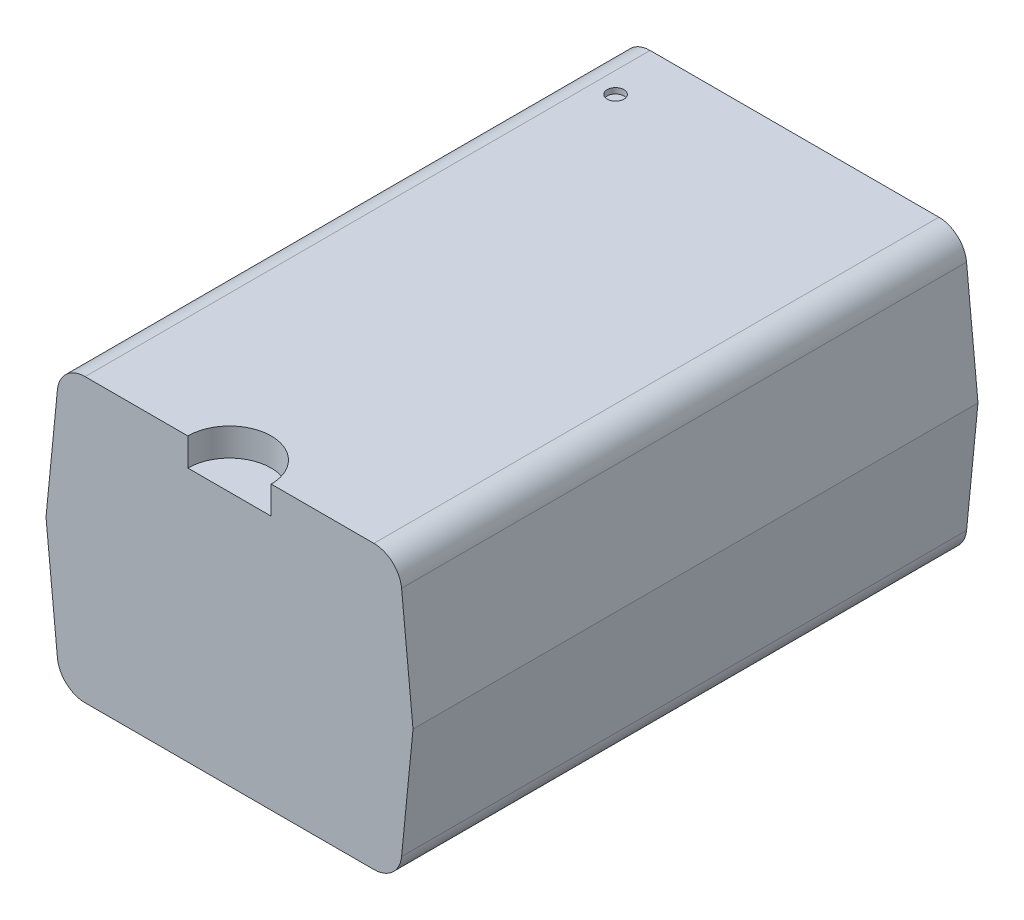
ISO-10303-21;
HEADER;
FILE_DESCRIPTION(('STEP AP214'),'2;1');
FILE_NAME('part.step','',(''),(''),'','','');
FILE_SCHEMA(('AUTOMOTIVE_DESIGN { 1 0 10303 214 1 1 1 1 }'));
ENDSEC;
DATA;
#1=APPLICATION_CONTEXT('core data for automotive mechanical design processes');
#2=APPLICATION_PROTOCOL_DEFINITION('international standard','automotive_design',2000,#1);
#3=PRODUCT_CONTEXT('',#1,'mechanical');
#4=PRODUCT('Part','Part','',(#3));
#5=PRODUCT_RELATED_PRODUCT_CATEGORY('part','',(#4));
#6=PRODUCT_DEFINITION_FORMATION('','',#4);
#7=PRODUCT_DEFINITION_CONTEXT('part definition',#1,'design');
#8=PRODUCT_DEFINITION('design','',#6,#7);
#9=PRODUCT_DEFINITION_SHAPE('','',#8);
#10=(LENGTH_UNIT() NAMED_UNIT(*) SI_UNIT(.MILLI.,.METRE.));
#11=(NAMED_UNIT(*) PLANE_ANGLE_UNIT() SI_UNIT($,.RADIAN.));
#12=(NAMED_UNIT(*) SI_UNIT($,.STERADIAN.) SOLID_ANGLE_UNIT());
#13=UNCERTAINTY_MEASURE_WITH_UNIT(LENGTH_MEASURE(1.E-05),#10,'distance_accuracy_value','');
#14=(GEOMETRIC_REPRESENTATION_CONTEXT(3) GLOBAL_UNCERTAINTY_ASSIGNED_CONTEXT((#13)) GLOBAL_UNIT_ASSIGNED_CONTEXT((#10,
#11,#12)) REPRESENTATION_CONTEXT('',''));
#15=CARTESIAN_POINT('',(0.,0.,0.));
#16=DIRECTION('',(0.,0.,1.));
#17=DIRECTION('',(1.,0.,0.));
#18=AXIS2_PLACEMENT_3D('',#15,#16,#17);
#19=CARTESIAN_POINT('',(-33.7891764057283,21.1911888467441,10.16));
#20=DIRECTION('',(0.995191151601001,-0.0979518850000986,0.));
#21=DIRECTION('',(0.0979518850000986,0.995191151601001,0.));
#22=AXIS2_PLACEMENT_3D('',#19,#20,#21);
#23=PLANE('',#22);
#24=DIRECTION('',(-0.0979518850000986,-0.995191151601001,0.));
#25=VECTOR('',#24,1.);
#26=CARTESIAN_POINT('',(-33.7891764057283,21.1911888467441,10.16));
#27=LINE('',#26,#25);
#28=CARTESIAN_POINT('',(-33.833568537372,20.7401647892442,10.16));
#29=VERTEX_POINT('',#28);
#30=CARTESIAN_POINT('',(-34.0391764057283,18.6511888467441,10.16));
#31=VERTEX_POINT('',#30);
#32=EDGE_CURVE('E165',#29,#31,#27,.T.);
#33=ORIENTED_EDGE('',*,*,#32,.F.);
#34=DIRECTION('',(0.,0.,-1.));
#35=VECTOR('',#34,1.);
#36=CARTESIAN_POINT('',(-33.833568537372,20.7401647892442,10.16));
#37=LINE('',#36,#35);
#38=CARTESIAN_POINT('',(-33.833568537372,20.7401647892442,0.));
#39=VERTEX_POINT('',#38);
#40=EDGE_CURVE('E194',#29,#39,#37,.T.);
#41=ORIENTED_EDGE('',*,*,#40,.T.);
#42=DIRECTION('',(-0.0979518850000986,-0.995191151601001,0.));
#43=VECTOR('',#42,1.);
#44=CARTESIAN_POINT('',(-33.7891764057283,21.1911888467441,0.));
#45=LINE('',#44,#43);
#46=CARTESIAN_POINT('',(-34.0391764057283,18.6511888467441,0.));
#47=VERTEX_POINT('',#46);
#48=EDGE_CURVE('E149',#39,#47,#45,.T.);
#49=ORIENTED_EDGE('',*,*,#48,.T.);
#50=DIRECTION('',(0.,0.,-1.));
#51=VECTOR('',#50,1.);
#52=CARTESIAN_POINT('',(-34.0391764057283,18.6511888467441,10.16));
#53=LINE('',#52,#51);
#54=EDGE_CURVE('E143',#31,#47,#53,.T.);
#55=ORIENTED_EDGE('',*,*,#54,.F.);
#56=EDGE_LOOP('',(#33,#41,#49,#55));
#57=FACE_BOUND('',#56,.T.);
#58=ADVANCED_FACE('F36',(#57),#23,.F.);
#59=CARTESIAN_POINT('',(-33.7891764057283,16.1111888467441,10.16));
#60=DIRECTION('',(0.995191151601001,0.0979518850000986,0.));
#61=DIRECTION('',(-0.0979518850000986,0.995191151601001,0.));
#62=AXIS2_PLACEMENT_3D('',#59,#60,#61);
#63=PLANE('',#62);
#64=DIRECTION('',(0.0979518850000986,-0.995191151601001,0.));
#65=VECTOR('',#64,1.);
#66=CARTESIAN_POINT('',(-33.7891764057283,16.1111888467441,0.));
#67=LINE('',#66,#65);
#68=CARTESIAN_POINT('',(-33.833568537372,16.5622129042441,0.));
#69=VERTEX_POINT('',#68);
#70=EDGE_CURVE('E151',#47,#69,#67,.T.);
#71=ORIENTED_EDGE('',*,*,#70,.T.);
#72=DIRECTION('',(0.,0.,-1.));
#73=VECTOR('',#72,1.);
#74=CARTESIAN_POINT('',(-33.833568537372,16.5622129042441,10.16));
#75=LINE('',#74,#73);
#76=CARTESIAN_POINT('',(-33.833568537372,16.5622129042441,10.16));
#77=VERTEX_POINT('',#76);
#78=EDGE_CURVE('E192',#69,#77,#75,.F.);
#79=ORIENTED_EDGE('',*,*,#78,.T.);
#80=DIRECTION('',(0.0979518850000986,-0.995191151601001,0.));
#81=VECTOR('',#80,1.);
#82=CARTESIAN_POINT('',(-33.7891764057283,16.1111888467441,10.16));
#83=LINE('',#82,#81);
#84=EDGE_CURVE('E248',#31,#77,#83,.T.);
#85=ORIENTED_EDGE('',*,*,#84,.F.);
#86=ORIENTED_EDGE('',*,*,#54,.T.);
#87=EDGE_LOOP('',(#71,#79,#85,#86));
#88=FACE_BOUND('',#87,.T.);
#89=ADVANCED_FACE('F213',(#88),#63,.F.);
#90=CARTESIAN_POINT('',(-33.7891764057283,16.1111888467441,10.16));
#91=DIRECTION('',(0.,1.,0.));
#92=DIRECTION('',(0.,0.,1.));
#93=AXIS2_PLACEMENT_3D('',#90,#91,#92);
#94=PLANE('',#93);
#95=DIRECTION('',(1.,0.,0.));
#96=VECTOR('',#95,1.);
#97=CARTESIAN_POINT('',(-33.7891764057283,16.1111888467441,0.));
#98=LINE('',#97,#96);
#99=CARTESIAN_POINT('',(-33.3359729615715,16.1111888467441,0.));
#100=VERTEX_POINT('',#99);
#101=CARTESIAN_POINT('',(-28.1423798498851,16.1111888467441,0.));
#102=VERTEX_POINT('',#101);
#103=EDGE_CURVE('E155',#100,#102,#98,.T.);
#104=ORIENTED_EDGE('',*,*,#103,.T.);
#105=DIRECTION('',(0.,0.,-1.));
#106=VECTOR('',#105,1.);
#107=CARTESIAN_POINT('',(-28.1423798498851,16.1111888467441,10.16));
#108=LINE('',#107,#106);
#109=CARTESIAN_POINT('',(-28.1423798498851,16.1111888467441,10.16));
#110=VERTEX_POINT('',#109);
#111=EDGE_CURVE('E183',#102,#110,#108,.F.);
#112=ORIENTED_EDGE('',*,*,#111,.T.);
#113=DIRECTION('',(1.,0.,0.));
#114=VECTOR('',#113,1.);
#115=CARTESIAN_POINT('',(-33.7891764057283,16.1111888467441,10.16));
#116=LINE('',#115,#114);
#117=CARTESIAN_POINT('',(-33.3359729615715,16.1111888467441,10.16));
#118=VERTEX_POINT('',#117);
#119=EDGE_CURVE('E250',#118,#110,#116,.T.);
#120=ORIENTED_EDGE('',*,*,#119,.F.);
#121=DIRECTION('',(0.,0.,-1.));
#122=VECTOR('',#121,1.);
#123=CARTESIAN_POINT('',(-33.3359729615715,16.1111888467441,10.16));
#124=LINE('',#123,#122);
#125=EDGE_CURVE('E180',#118,#100,#124,.T.);
#126=ORIENTED_EDGE('',*,*,#125,.T.);
#127=EDGE_LOOP('',(#104,#112,#120,#126));
#128=FACE_BOUND('',#127,.T.);
#129=ADVANCED_FACE('F219',(#128),#94,.F.);
#130=CARTESIAN_POINT('',(-27.6891764057283,16.1111888467441,10.16));
#131=DIRECTION('',(-0.995191151601001,0.0979518850001,0.));
#132=DIRECTION('',(-0.0979518850001,-0.995191151601001,0.));
#133=AXIS2_PLACEMENT_3D('',#130,#131,#132);
#134=PLANE('',#133);
#135=DIRECTION('',(0.0979518850001,0.995191151601001,0.));
#136=VECTOR('',#135,1.);
#137=CARTESIAN_POINT('',(-27.6891764057283,16.1111888467441,10.16));
#138=LINE('',#137,#136);
#139=CARTESIAN_POINT('',(-27.6447842740846,16.5622129042441,10.16));
#140=VERTEX_POINT('',#139);
#141=CARTESIAN_POINT('',(-27.4391764057283,18.6511888467441,10.16));
#142=VERTEX_POINT('',#141);
#143=EDGE_CURVE('E257',#140,#142,#138,.T.);
#144=ORIENTED_EDGE('',*,*,#143,.F.);
#145=DIRECTION('',(0.,0.,-1.));
#146=VECTOR('',#145,1.);
#147=CARTESIAN_POINT('',(-27.6447842740846,16.5622129042441,10.16));
#148=LINE('',#147,#146);
#149=CARTESIAN_POINT('',(-27.6447842740846,16.5622129042441,0.));
#150=VERTEX_POINT('',#149);
#151=EDGE_CURVE('E169',#140,#150,#148,.T.);
#152=ORIENTED_EDGE('',*,*,#151,.T.);
#153=DIRECTION('',(0.0979518850001,0.995191151601001,0.));
#154=VECTOR('',#153,1.);
#155=CARTESIAN_POINT('',(-27.6891764057283,16.1111888467441,0.));
#156=LINE('',#155,#154);
#157=CARTESIAN_POINT('',(-27.4391764057283,18.6511888467441,0.));
#158=VERTEX_POINT('',#157);
#159=EDGE_CURVE('E158',#150,#158,#156,.T.);
#160=ORIENTED_EDGE('',*,*,#159,.T.);
#161=DIRECTION('',(0.,0.,-1.));
#162=VECTOR('',#161,1.);
#163=CARTESIAN_POINT('',(-27.4391764057283,18.6511888467441,10.16));
#164=LINE('',#163,#162);
#165=EDGE_CURVE('E140',#142,#158,#164,.T.);
#166=ORIENTED_EDGE('',*,*,#165,.F.);
#167=EDGE_LOOP('',(#144,#152,#160,#166));
#168=FACE_BOUND('',#167,.T.);
#169=ADVANCED_FACE('F278',(#168),#134,.F.);
#170=CARTESIAN_POINT('',(-27.6891764057283,21.1911888467441,10.16));
#171=DIRECTION('',(-0.995191151601001,-0.0979518850001,0.));
#172=DIRECTION('',(0.0979518850001,-0.995191151601001,0.));
#173=AXIS2_PLACEMENT_3D('',#170,#171,#172);
#174=PLANE('',#173);
#175=DIRECTION('',(-0.0979518850001,0.995191151601001,0.));
#176=VECTOR('',#175,1.);
#177=CARTESIAN_POINT('',(-27.6891764057283,21.1911888467441,0.));
#178=LINE('',#177,#176);
#179=CARTESIAN_POINT('',(-27.6447842740846,20.7401647892442,0.));
#180=VERTEX_POINT('',#179);
#181=EDGE_CURVE('E160',#158,#180,#178,.T.);
#182=ORIENTED_EDGE('',*,*,#181,.T.);
#183=DIRECTION('',(0.,0.,-1.));
#184=VECTOR('',#183,1.);
#185=CARTESIAN_POINT('',(-27.6447842740846,20.7401647892442,10.16));
#186=LINE('',#185,#184);
#187=CARTESIAN_POINT('',(-27.6447842740846,20.7401647892442,10.16));
#188=VERTEX_POINT('',#187);
#189=EDGE_CURVE('E201',#180,#188,#186,.F.);
#190=ORIENTED_EDGE('',*,*,#189,.T.);
#191=DIRECTION('',(-0.0979518850001,0.995191151601001,0.));
#192=VECTOR('',#191,1.);
#193=CARTESIAN_POINT('',(-27.6891764057283,21.1911888467441,10.16));
#194=LINE('',#193,#192);
#195=EDGE_CURVE('E145',#142,#188,#194,.T.);
#196=ORIENTED_EDGE('',*,*,#195,.F.);
#197=ORIENTED_EDGE('',*,*,#165,.T.);
#198=EDGE_LOOP('',(#182,#190,#196,#197));
#199=FACE_BOUND('',#198,.T.);
#200=ADVANCED_FACE('F279',(#199),#174,.F.);
#201=CARTESIAN_POINT('',(-33.7891764057283,21.1911888467441,10.16));
#202=DIRECTION('',(0.,-1.,0.));
#203=DIRECTION('',(0.,0.,-1.));
#204=AXIS2_PLACEMENT_3D('',#201,#202,#203);
#205=PLANE('',#204);
#206=CARTESIAN_POINT('',(-32.9620048142087,21.1911888467441,0.994910082684375));
#207=DIRECTION('',(0.,1.,0.));
#208=DIRECTION('',(0.,0.,1.));
#209=AXIS2_PLACEMENT_3D('',#206,#207,#208);
#210=CIRCLE('',#209,0.149999999999998);
#211=CARTESIAN_POINT('',(-32.9620048142087,21.1911888467441,1.14491008268437));
#212=VERTEX_POINT('',#211);
#213=EDGE_CURVE('E253',#212,#212,#210,.T.);
#214=ORIENTED_EDGE('',*,*,#213,.F.);
#215=EDGE_LOOP('',(#214));
#216=FACE_BOUND('',#215,.T.);
#217=DIRECTION('',(-1.,0.,0.));
#218=VECTOR('',#217,1.);
#219=CARTESIAN_POINT('',(-33.7891764057283,21.1911888467441,10.16));
#220=LINE('',#219,#218);
#221=CARTESIAN_POINT('',(-31.4891764057283,21.1911888467441,10.16));
#222=VERTEX_POINT('',#221);
#223=CARTESIAN_POINT('',(-33.3359729615715,21.1911888467441,10.16));
#224=VERTEX_POINT('',#223);
#225=EDGE_CURVE('E58',#222,#224,#220,.T.);
#226=ORIENTED_EDGE('',*,*,#225,.F.);
#227=CARTESIAN_POINT('',(-30.7391764057283,21.1911888467441,10.16));
#228=DIRECTION('',(0.,1.,0.));
#229=DIRECTION('',(0.,0.,1.));
#230=AXIS2_PLACEMENT_3D('',#227,#228,#229);
#231=CIRCLE('',#230,0.750000000000002);
#232=CARTESIAN_POINT('',(-29.9891764057283,21.1911888467441,10.16));
#233=VERTEX_POINT('',#232);
#234=EDGE_CURVE('E126',#233,#222,#231,.T.);
#235=ORIENTED_EDGE('',*,*,#234,.F.);
#236=CARTESIAN_POINT('',(-28.1423798498851,21.1911888467441,10.16));
#237=VERTEX_POINT('',#236);
#238=EDGE_CURVE('E133',#237,#233,#220,.T.);
#239=ORIENTED_EDGE('',*,*,#238,.F.);
#240=DIRECTION('',(0.,0.,-1.));
#241=VECTOR('',#240,1.);
#242=CARTESIAN_POINT('',(-28.1423798498851,21.1911888467441,10.16));
#243=LINE('',#242,#241);
#244=CARTESIAN_POINT('',(-28.1423798498851,21.1911888467441,0.));
#245=VERTEX_POINT('',#244);
#246=EDGE_CURVE('E197',#237,#245,#243,.T.);
#247=ORIENTED_EDGE('',*,*,#246,.T.);
#248=DIRECTION('',(-1.,0.,0.));
#249=VECTOR('',#248,1.);
#250=CARTESIAN_POINT('',(-33.7891764057283,21.1911888467441,0.));
#251=LINE('',#250,#249);
#252=CARTESIAN_POINT('',(-33.3359729615715,21.1911888467441,0.));
#253=VERTEX_POINT('',#252);
#254=EDGE_CURVE('E163',#245,#253,#251,.T.);
#255=ORIENTED_EDGE('',*,*,#254,.T.);
#256=DIRECTION('',(0.,0.,-1.));
#257=VECTOR('',#256,1.);
#258=CARTESIAN_POINT('',(-33.3359729615715,21.1911888467441,10.16));
#259=LINE('',#258,#257);
#260=EDGE_CURVE('E199',#253,#224,#259,.F.);
#261=ORIENTED_EDGE('',*,*,#260,.T.);
#262=EDGE_LOOP('',(#226,#235,#239,#247,#255,#261));
#263=FACE_BOUND('',#262,.T.);
#264=ADVANCED_FACE('F131',(#216,#263),#205,.F.);
#265=CARTESIAN_POINT('',(0.,0.,10.16));
#266=DIRECTION('',(0.,0.,1.));
#267=DIRECTION('',(1.,0.,0.));
#268=AXIS2_PLACEMENT_3D('',#265,#266,#267);
#269=PLANE('',#268);
#270=DIRECTION('',(0.,1.,0.));
#271=VECTOR('',#270,1.);
#272=CARTESIAN_POINT('',(-29.9891764057283,20.6911888467441,10.16));
#273=LINE('',#272,#271);
#274=CARTESIAN_POINT('',(-29.9891764057283,20.6911888467441,10.16));
#275=VERTEX_POINT('',#274);
#276=EDGE_CURVE('E11',#275,#233,#273,.T.);
#277=ORIENTED_EDGE('',*,*,#276,.F.);
#278=DIRECTION('',(-1.,0.,0.));
#279=VECTOR('',#278,1.);
#280=CARTESIAN_POINT('',(0.,20.6911888467441,10.16));
#281=LINE('',#280,#279);
#282=CARTESIAN_POINT('',(-31.4891764057283,20.6911888467441,10.16));
#283=VERTEX_POINT('',#282);
#284=EDGE_CURVE('E203',#275,#283,#281,.T.);
#285=ORIENTED_EDGE('',*,*,#284,.T.);
#286=DIRECTION('',(0.,1.,0.));
#287=VECTOR('',#286,1.);
#288=CARTESIAN_POINT('',(-31.4891764057283,20.6911888467441,10.16));
#289=LINE('',#288,#287);
#290=EDGE_CURVE('E44',#222,#283,#289,.F.);
#291=ORIENTED_EDGE('',*,*,#290,.F.);
#292=ORIENTED_EDGE('',*,*,#225,.T.);
#293=CARTESIAN_POINT('',(-33.3359729615715,20.6911888467441,10.16));
#294=DIRECTION('',(0.,0.,1.));
#295=DIRECTION('',(1.,0.,0.));
#296=AXIS2_PLACEMENT_3D('',#293,#294,#295);
#297=CIRCLE('',#296,0.5);
#298=EDGE_CURVE('E186',#224,#29,#297,.T.);
#299=ORIENTED_EDGE('',*,*,#298,.T.);
#300=ORIENTED_EDGE('',*,*,#32,.T.);
#301=ORIENTED_EDGE('',*,*,#84,.T.);
#302=CARTESIAN_POINT('',(-33.3359729615715,16.6111888467441,10.16));
#303=DIRECTION('',(0.,0.,1.));
#304=DIRECTION('',(1.,0.,0.));
#305=AXIS2_PLACEMENT_3D('',#302,#303,#304);
#306=CIRCLE('',#305,0.5);
#307=EDGE_CURVE('E188',#77,#118,#306,.T.);
#308=ORIENTED_EDGE('',*,*,#307,.T.);
#309=ORIENTED_EDGE('',*,*,#119,.T.);
#310=CARTESIAN_POINT('',(-28.1423798498851,16.6111888467441,10.16));
#311=DIRECTION('',(0.,0.,1.));
#312=DIRECTION('',(1.,0.,0.));
#313=AXIS2_PLACEMENT_3D('',#310,#311,#312);
#314=CIRCLE('',#313,0.5);
#315=EDGE_CURVE('E190',#110,#140,#314,.T.);
#316=ORIENTED_EDGE('',*,*,#315,.T.);
#317=ORIENTED_EDGE('',*,*,#143,.T.);
#318=ORIENTED_EDGE('',*,*,#195,.T.);
#319=CARTESIAN_POINT('',(-28.1423798498851,20.6911888467441,10.16));
#320=DIRECTION('',(0.,0.,1.));
#321=DIRECTION('',(1.,0.,0.));
#322=AXIS2_PLACEMENT_3D('',#319,#320,#321);
#323=CIRCLE('',#322,0.5);
#324=EDGE_CURVE('E139',#188,#237,#323,.T.);
#325=ORIENTED_EDGE('',*,*,#324,.T.);
#326=ORIENTED_EDGE('',*,*,#238,.T.);
#327=EDGE_LOOP('',(#277,#285,#291,#292,#299,#300,#301,#308,#309,#316,#317,#318,#325,#326));
#328=FACE_BOUND('',#327,.T.);
#329=ADVANCED_FACE('F136',(#328),#269,.T.);
#330=CARTESIAN_POINT('',(0.,0.,0.));
#331=DIRECTION('',(0.,0.,1.));
#332=DIRECTION('',(1.,0.,0.));
#333=AXIS2_PLACEMENT_3D('',#330,#331,#332);
#334=PLANE('',#333);
#335=ORIENTED_EDGE('',*,*,#159,.F.);
#336=CARTESIAN_POINT('',(-28.1423798498851,16.6111888467441,0.));
#337=DIRECTION('',(0.,0.,1.));
#338=DIRECTION('',(1.,0.,0.));
#339=AXIS2_PLACEMENT_3D('',#336,#337,#338);
#340=CIRCLE('',#339,0.5);
#341=EDGE_CURVE('E178',#150,#102,#340,.F.);
#342=ORIENTED_EDGE('',*,*,#341,.T.);
#343=ORIENTED_EDGE('',*,*,#103,.F.);
#344=CARTESIAN_POINT('',(-33.3359729615715,16.6111888467441,0.));
#345=DIRECTION('',(0.,0.,1.));
#346=DIRECTION('',(1.,0.,0.));
#347=AXIS2_PLACEMENT_3D('',#344,#345,#346);
#348=CIRCLE('',#347,0.5);
#349=EDGE_CURVE('E176',#100,#69,#348,.F.);
#350=ORIENTED_EDGE('',*,*,#349,.T.);
#351=ORIENTED_EDGE('',*,*,#70,.F.);
#352=ORIENTED_EDGE('',*,*,#48,.F.);
#353=CARTESIAN_POINT('',(-33.3359729615715,20.6911888467441,0.));
#354=DIRECTION('',(0.,0.,1.));
#355=DIRECTION('',(1.,0.,0.));
#356=AXIS2_PLACEMENT_3D('',#353,#354,#355);
#357=CIRCLE('',#356,0.5);
#358=EDGE_CURVE('E174',#39,#253,#357,.F.);
#359=ORIENTED_EDGE('',*,*,#358,.T.);
#360=ORIENTED_EDGE('',*,*,#254,.F.);
#361=CARTESIAN_POINT('',(-28.1423798498851,20.6911888467441,0.));
#362=DIRECTION('',(0.,0.,1.));
#363=DIRECTION('',(1.,0.,0.));
#364=AXIS2_PLACEMENT_3D('',#361,#362,#363);
#365=CIRCLE('',#364,0.5);
#366=EDGE_CURVE('E172',#245,#180,#365,.F.);
#367=ORIENTED_EDGE('',*,*,#366,.T.);
#368=ORIENTED_EDGE('',*,*,#181,.F.);
#369=EDGE_LOOP('',(#335,#342,#343,#350,#351,#352,#359,#360,#367,#368));
#370=FACE_BOUND('',#369,.T.);
#371=ADVANCED_FACE('F229',(#370),#334,.F.);
#372=CARTESIAN_POINT('',(-28.1423798498851,16.6111888467441,10.16));
#373=DIRECTION('',(0.,0.,-1.));
#374=DIRECTION('',(-1.,0.,0.));
#375=AXIS2_PLACEMENT_3D('',#372,#373,#374);
#376=CYLINDRICAL_SURFACE('',#375,0.5);
#377=ORIENTED_EDGE('',*,*,#315,.F.);
#378=ORIENTED_EDGE('',*,*,#111,.F.);
#379=ORIENTED_EDGE('',*,*,#341,.F.);
#380=ORIENTED_EDGE('',*,*,#151,.F.);
#381=EDGE_LOOP('',(#377,#378,#379,#380));
#382=FACE_BOUND('',#381,.T.);
#383=ADVANCED_FACE('F225',(#382),#376,.T.);
#384=CARTESIAN_POINT('',(-33.3359729615715,16.6111888467441,10.16));
#385=DIRECTION('',(0.,0.,-1.));
#386=DIRECTION('',(-1.,0.,0.));
#387=AXIS2_PLACEMENT_3D('',#384,#385,#386);
#388=CYLINDRICAL_SURFACE('',#387,0.5);
#389=ORIENTED_EDGE('',*,*,#307,.F.);
#390=ORIENTED_EDGE('',*,*,#78,.F.);
#391=ORIENTED_EDGE('',*,*,#349,.F.);
#392=ORIENTED_EDGE('',*,*,#125,.F.);
#393=EDGE_LOOP('',(#389,#390,#391,#392));
#394=FACE_BOUND('',#393,.T.);
#395=ADVANCED_FACE('F228',(#394),#388,.T.);
#396=CARTESIAN_POINT('',(-33.3359729615715,20.6911888467441,10.16));
#397=DIRECTION('',(0.,0.,-1.));
#398=DIRECTION('',(-1.,0.,0.));
#399=AXIS2_PLACEMENT_3D('',#396,#397,#398);
#400=CYLINDRICAL_SURFACE('',#399,0.5);
#401=ORIENTED_EDGE('',*,*,#298,.F.);
#402=ORIENTED_EDGE('',*,*,#260,.F.);
#403=ORIENTED_EDGE('',*,*,#358,.F.);
#404=ORIENTED_EDGE('',*,*,#40,.F.);
#405=EDGE_LOOP('',(#401,#402,#403,#404));
#406=FACE_BOUND('',#405,.T.);
#407=ADVANCED_FACE('F232',(#406),#400,.T.);
#408=CARTESIAN_POINT('',(-28.1423798498851,20.6911888467441,10.16));
#409=DIRECTION('',(0.,0.,-1.));
#410=DIRECTION('',(-1.,0.,0.));
#411=AXIS2_PLACEMENT_3D('',#408,#409,#410);
#412=CYLINDRICAL_SURFACE('',#411,0.5);
#413=ORIENTED_EDGE('',*,*,#324,.F.);
#414=ORIENTED_EDGE('',*,*,#189,.F.);
#415=ORIENTED_EDGE('',*,*,#366,.F.);
#416=ORIENTED_EDGE('',*,*,#246,.F.);
#417=EDGE_LOOP('',(#413,#414,#415,#416));
#418=FACE_BOUND('',#417,.T.);
#419=ADVANCED_FACE('F38',(#418),#412,.T.);
#420=CARTESIAN_POINT('',(-32.9620048142087,21.0911888467441,0.994910082684375));
#421=DIRECTION('',(0.,1.,0.));
#422=DIRECTION('',(0.,0.,1.));
#423=AXIS2_PLACEMENT_3D('',#420,#421,#422);
#424=CYLINDRICAL_SURFACE('',#423,0.149999999999998);
#425=CARTESIAN_POINT('',(-32.9620048142087,21.0911888467441,0.994910082684375));
#426=DIRECTION('',(0.,1.,0.));
#427=DIRECTION('',(0.,0.,1.));
#428=AXIS2_PLACEMENT_3D('',#425,#426,#427);
#429=CIRCLE('',#428,0.149999999999998);
#430=CARTESIAN_POINT('',(-32.9620048142087,21.0911888467441,1.14491008268437));
#431=VERTEX_POINT('',#430);
#432=EDGE_CURVE('E152',#431,#431,#429,.T.);
#433=ORIENTED_EDGE('',*,*,#432,.F.);
#434=EDGE_LOOP('',(#433));
#435=FACE_BOUND('',#434,.T.);
#436=ORIENTED_EDGE('',*,*,#213,.T.);
#437=EDGE_LOOP('',(#436));
#438=FACE_BOUND('',#437,.T.);
#439=ADVANCED_FACE('F239',(#435,#438),#424,.F.);
#440=CARTESIAN_POINT('',(-32.9620048142087,21.0911888467441,0.994910082684375));
#441=DIRECTION('',(0.,1.,0.));
#442=DIRECTION('',(0.,0.,1.));
#443=AXIS2_PLACEMENT_3D('',#440,#441,#442);
#444=PLANE('',#443);
#445=ORIENTED_EDGE('',*,*,#432,.T.);
#446=EDGE_LOOP('',(#445));
#447=FACE_BOUND('',#446,.T.);
#448=ADVANCED_FACE('F210',(#447),#444,.T.);
#449=CARTESIAN_POINT('',(-30.7391764057283,20.6911888467441,10.16));
#450=DIRECTION('',(0.,1.,0.));
#451=DIRECTION('',(0.,0.,1.));
#452=AXIS2_PLACEMENT_3D('',#449,#450,#451);
#453=CYLINDRICAL_SURFACE('',#452,0.750000000000002);
#454=ORIENTED_EDGE('',*,*,#276,.T.);
#455=ORIENTED_EDGE('',*,*,#234,.T.);
#456=ORIENTED_EDGE('',*,*,#290,.T.);
#457=CARTESIAN_POINT('',(-30.7391764057283,20.6911888467441,10.16));
#458=DIRECTION('',(0.,1.,0.));
#459=DIRECTION('',(0.,0.,1.));
#460=AXIS2_PLACEMENT_3D('',#457,#458,#459);
#461=CIRCLE('',#460,0.750000000000002);
#462=EDGE_CURVE('E50',#275,#283,#461,.T.);
#463=ORIENTED_EDGE('',*,*,#462,.F.);
#464=EDGE_LOOP('',(#454,#455,#456,#463));
#465=FACE_BOUND('',#464,.T.);
#466=ADVANCED_FACE('F125',(#465),#453,.F.);
#467=CARTESIAN_POINT('',(-30.7391764057283,20.6911888467441,10.16));
#468=DIRECTION('',(0.,1.,0.));
#469=DIRECTION('',(0.,0.,1.));
#470=AXIS2_PLACEMENT_3D('',#467,#468,#469);
#471=PLANE('',#470);
#472=ORIENTED_EDGE('',*,*,#462,.T.);
#473=ORIENTED_EDGE('',*,*,#284,.F.);
#474=EDGE_LOOP('',(#472,#473));
#475=FACE_BOUND('',#474,.T.);
#476=ADVANCED_FACE('F204',(#475),#471,.T.);
#477=CLOSED_SHELL('',(#58,#89,#129,#169,#200,#264,#329,#371,#383,#395,#407,#419,#439,#448,#466,#476));
#478=MANIFOLD_SOLID_BREP('B2',#477);
#479=ADVANCED_BREP_SHAPE_REPRESENTATION('',(#18,#478),#14);
#480=SHAPE_DEFINITION_REPRESENTATION(#9,#479);
ENDSEC;
END-ISO-10303-21;
